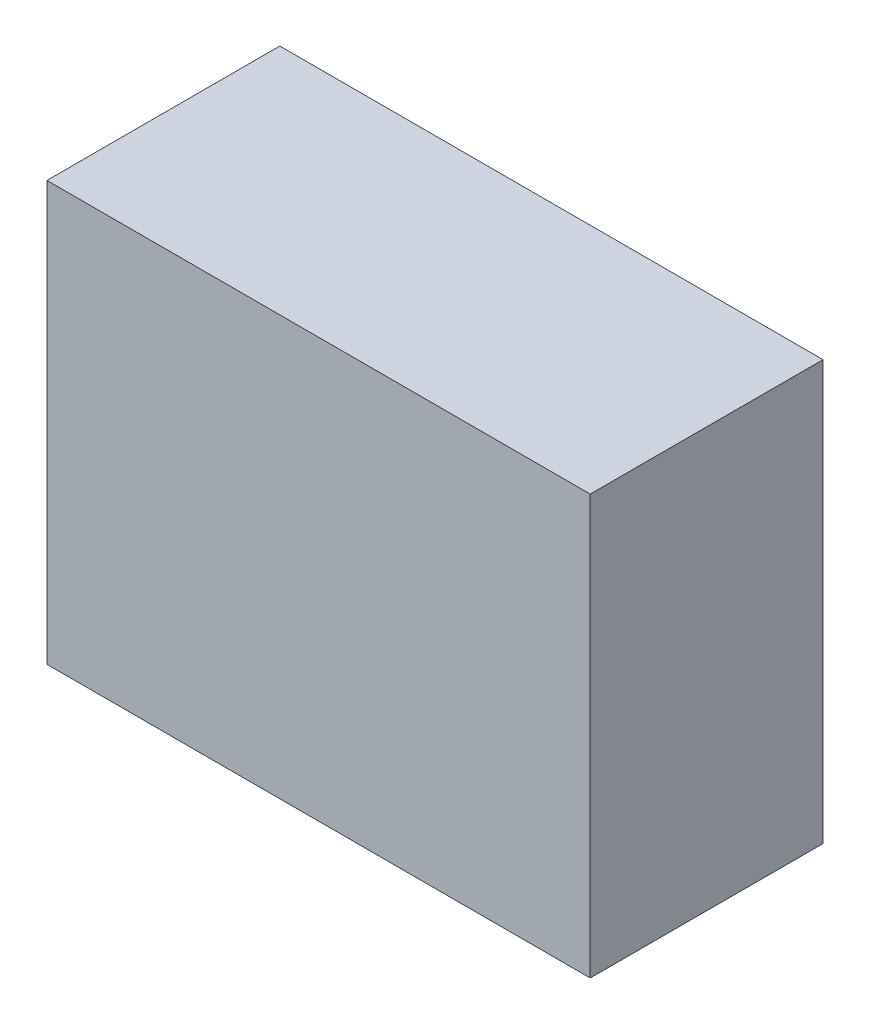
ISO-10303-21;
HEADER;
FILE_DESCRIPTION(('STEP AP214'),'2;1');
FILE_NAME('part.step','',(''),(''),'','','');
FILE_SCHEMA(('AUTOMOTIVE_DESIGN { 1 0 10303 214 1 1 1 1 }'));
ENDSEC;
DATA;
#1=APPLICATION_CONTEXT('core data for automotive mechanical design processes');
#2=APPLICATION_PROTOCOL_DEFINITION('international standard','automotive_design',2000,#1);
#3=PRODUCT_CONTEXT('',#1,'mechanical');
#4=PRODUCT('Part','Part','',(#3));
#5=PRODUCT_RELATED_PRODUCT_CATEGORY('part','',(#4));
#6=PRODUCT_DEFINITION_FORMATION('','',#4);
#7=PRODUCT_DEFINITION_CONTEXT('part definition',#1,'design');
#8=PRODUCT_DEFINITION('design','',#6,#7);
#9=PRODUCT_DEFINITION_SHAPE('','',#8);
#10=(LENGTH_UNIT() NAMED_UNIT(*) SI_UNIT(.MILLI.,.METRE.));
#11=(NAMED_UNIT(*) PLANE_ANGLE_UNIT() SI_UNIT($,.RADIAN.));
#12=(NAMED_UNIT(*) SI_UNIT($,.STERADIAN.) SOLID_ANGLE_UNIT());
#13=UNCERTAINTY_MEASURE_WITH_UNIT(LENGTH_MEASURE(1.E-05),#10,'distance_accuracy_value','');
#14=(GEOMETRIC_REPRESENTATION_CONTEXT(3) GLOBAL_UNCERTAINTY_ASSIGNED_CONTEXT((#13)) GLOBAL_UNIT_ASSIGNED_CONTEXT((#10,
#11,#12)) REPRESENTATION_CONTEXT('',''));
#15=CARTESIAN_POINT('',(0.,0.,0.));
#16=DIRECTION('',(0.,0.,1.));
#17=DIRECTION('',(1.,0.,0.));
#18=AXIS2_PLACEMENT_3D('',#15,#16,#17);
#19=CARTESIAN_POINT('',(0.,0.,30.));
#20=DIRECTION('',(1.,0.,0.));
#21=DIRECTION('',(0.,0.,-1.));
#22=AXIS2_PLACEMENT_3D('',#19,#20,#21);
#23=PLANE('',#22);
#24=DIRECTION('',(0.,-1.,0.));
#25=VECTOR('',#24,1.);
#26=CARTESIAN_POINT('',(0.,0.,0.));
#27=LINE('',#26,#25);
#28=CARTESIAN_POINT('',(0.,54.,0.));
#29=VERTEX_POINT('',#28);
#30=CARTESIAN_POINT('',(0.,0.,0.));
#31=VERTEX_POINT('',#30);
#32=EDGE_CURVE('E96',#29,#31,#27,.T.);
#33=ORIENTED_EDGE('',*,*,#32,.T.);
#34=DIRECTION('',(0.,0.,-1.));
#35=VECTOR('',#34,1.);
#36=CARTESIAN_POINT('',(0.,0.,30.));
#37=LINE('',#36,#35);
#38=CARTESIAN_POINT('',(0.,0.,30.));
#39=VERTEX_POINT('',#38);
#40=EDGE_CURVE('E11',#39,#31,#37,.T.);
#41=ORIENTED_EDGE('',*,*,#40,.F.);
#42=DIRECTION('',(0.,-1.,0.));
#43=VECTOR('',#42,1.);
#44=CARTESIAN_POINT('',(0.,0.,30.));
#45=LINE('',#44,#43);
#46=CARTESIAN_POINT('',(0.,54.,30.));
#47=VERTEX_POINT('',#46);
#48=EDGE_CURVE('E84',#47,#39,#45,.T.);
#49=ORIENTED_EDGE('',*,*,#48,.F.);
#50=DIRECTION('',(0.,0.,-1.));
#51=VECTOR('',#50,1.);
#52=CARTESIAN_POINT('',(0.,54.,30.));
#53=LINE('',#52,#51);
#54=EDGE_CURVE('E92',#47,#29,#53,.T.);
#55=ORIENTED_EDGE('',*,*,#54,.T.);
#56=EDGE_LOOP('',(#33,#41,#49,#55));
#57=FACE_BOUND('',#56,.T.);
#58=ADVANCED_FACE('F33',(#57),#23,.F.);
#59=CARTESIAN_POINT('',(0.,0.,30.));
#60=DIRECTION('',(0.,1.,0.));
#61=DIRECTION('',(0.,0.,1.));
#62=AXIS2_PLACEMENT_3D('',#59,#60,#61);
#63=PLANE('',#62);
#64=DIRECTION('',(1.,0.,0.));
#65=VECTOR('',#64,1.);
#66=CARTESIAN_POINT('',(0.,0.,0.));
#67=LINE('',#66,#65);
#68=CARTESIAN_POINT('',(70.,0.,0.));
#69=VERTEX_POINT('',#68);
#70=EDGE_CURVE('E88',#31,#69,#67,.T.);
#71=ORIENTED_EDGE('',*,*,#70,.T.);
#72=DIRECTION('',(0.,0.,-1.));
#73=VECTOR('',#72,1.);
#74=CARTESIAN_POINT('',(70.,0.,30.));
#75=LINE('',#74,#73);
#76=CARTESIAN_POINT('',(70.,0.,30.));
#77=VERTEX_POINT('',#76);
#78=EDGE_CURVE('E41',#77,#69,#75,.T.);
#79=ORIENTED_EDGE('',*,*,#78,.F.);
#80=DIRECTION('',(1.,0.,0.));
#81=VECTOR('',#80,1.);
#82=CARTESIAN_POINT('',(0.,0.,30.));
#83=LINE('',#82,#81);
#84=EDGE_CURVE('E79',#39,#77,#83,.T.);
#85=ORIENTED_EDGE('',*,*,#84,.F.);
#86=ORIENTED_EDGE('',*,*,#40,.T.);
#87=EDGE_LOOP('',(#71,#79,#85,#86));
#88=FACE_BOUND('',#87,.T.);
#89=ADVANCED_FACE('F87',(#88),#63,.F.);
#90=CARTESIAN_POINT('',(70.,0.,30.));
#91=DIRECTION('',(-1.,0.,0.));
#92=DIRECTION('',(0.,0.,1.));
#93=AXIS2_PLACEMENT_3D('',#90,#91,#92);
#94=PLANE('',#93);
#95=DIRECTION('',(0.,1.,0.));
#96=VECTOR('',#95,1.);
#97=CARTESIAN_POINT('',(70.,0.,0.));
#98=LINE('',#97,#96);
#99=CARTESIAN_POINT('',(70.,54.,0.));
#100=VERTEX_POINT('',#99);
#101=EDGE_CURVE('E66',#69,#100,#98,.T.);
#102=ORIENTED_EDGE('',*,*,#101,.T.);
#103=DIRECTION('',(0.,0.,-1.));
#104=VECTOR('',#103,1.);
#105=CARTESIAN_POINT('',(70.,54.,30.));
#106=LINE('',#105,#104);
#107=CARTESIAN_POINT('',(70.,54.,30.));
#108=VERTEX_POINT('',#107);
#109=EDGE_CURVE('E89',#108,#100,#106,.T.);
#110=ORIENTED_EDGE('',*,*,#109,.F.);
#111=DIRECTION('',(0.,1.,0.));
#112=VECTOR('',#111,1.);
#113=CARTESIAN_POINT('',(70.,0.,30.));
#114=LINE('',#113,#112);
#115=EDGE_CURVE('E82',#77,#108,#114,.T.);
#116=ORIENTED_EDGE('',*,*,#115,.F.);
#117=ORIENTED_EDGE('',*,*,#78,.T.);
#118=EDGE_LOOP('',(#102,#110,#116,#117));
#119=FACE_BOUND('',#118,.T.);
#120=ADVANCED_FACE('F90',(#119),#94,.F.);
#121=CARTESIAN_POINT('',(0.,54.,30.));
#122=DIRECTION('',(0.,-1.,0.));
#123=DIRECTION('',(0.,0.,-1.));
#124=AXIS2_PLACEMENT_3D('',#121,#122,#123);
#125=PLANE('',#124);
#126=DIRECTION('',(-1.,0.,0.));
#127=VECTOR('',#126,1.);
#128=CARTESIAN_POINT('',(0.,54.,0.));
#129=LINE('',#128,#127);
#130=EDGE_CURVE('E72',#100,#29,#129,.T.);
#131=ORIENTED_EDGE('',*,*,#130,.T.);
#132=ORIENTED_EDGE('',*,*,#54,.F.);
#133=DIRECTION('',(-1.,0.,0.));
#134=VECTOR('',#133,1.);
#135=CARTESIAN_POINT('',(0.,54.,30.));
#136=LINE('',#135,#134);
#137=EDGE_CURVE('E49',#108,#47,#136,.T.);
#138=ORIENTED_EDGE('',*,*,#137,.F.);
#139=ORIENTED_EDGE('',*,*,#109,.T.);
#140=EDGE_LOOP('',(#131,#132,#138,#139));
#141=FACE_BOUND('',#140,.T.);
#142=ADVANCED_FACE('F103',(#141),#125,.F.);
#143=CARTESIAN_POINT('',(0.,54.,30.));
#144=DIRECTION('',(0.,0.,-1.));
#145=DIRECTION('',(-1.,0.,0.));
#146=AXIS2_PLACEMENT_3D('',#143,#144,#145);
#147=PLANE('',#146);
#148=ORIENTED_EDGE('',*,*,#48,.T.);
#149=ORIENTED_EDGE('',*,*,#84,.T.);
#150=ORIENTED_EDGE('',*,*,#115,.T.);
#151=ORIENTED_EDGE('',*,*,#137,.T.);
#152=EDGE_LOOP('',(#148,#149,#150,#151));
#153=FACE_BOUND('',#152,.T.);
#154=ADVANCED_FACE('F80',(#153),#147,.F.);
#155=CARTESIAN_POINT('',(0.,54.,0.));
#156=DIRECTION('',(0.,0.,-1.));
#157=DIRECTION('',(-1.,0.,0.));
#158=AXIS2_PLACEMENT_3D('',#155,#156,#157);
#159=PLANE('',#158);
#160=ORIENTED_EDGE('',*,*,#32,.F.);
#161=ORIENTED_EDGE('',*,*,#130,.F.);
#162=ORIENTED_EDGE('',*,*,#101,.F.);
#163=ORIENTED_EDGE('',*,*,#70,.F.);
#164=EDGE_LOOP('',(#160,#161,#162,#163));
#165=FACE_BOUND('',#164,.T.);
#166=ADVANCED_FACE('F106',(#165),#159,.T.);
#167=CLOSED_SHELL('',(#58,#89,#120,#142,#154,#166));
#168=MANIFOLD_SOLID_BREP('B2',#167);
#169=ADVANCED_BREP_SHAPE_REPRESENTATION('',(#18,#168),#14);
#170=SHAPE_DEFINITION_REPRESENTATION(#9,#169);
ENDSEC;
END-ISO-10303-21;
